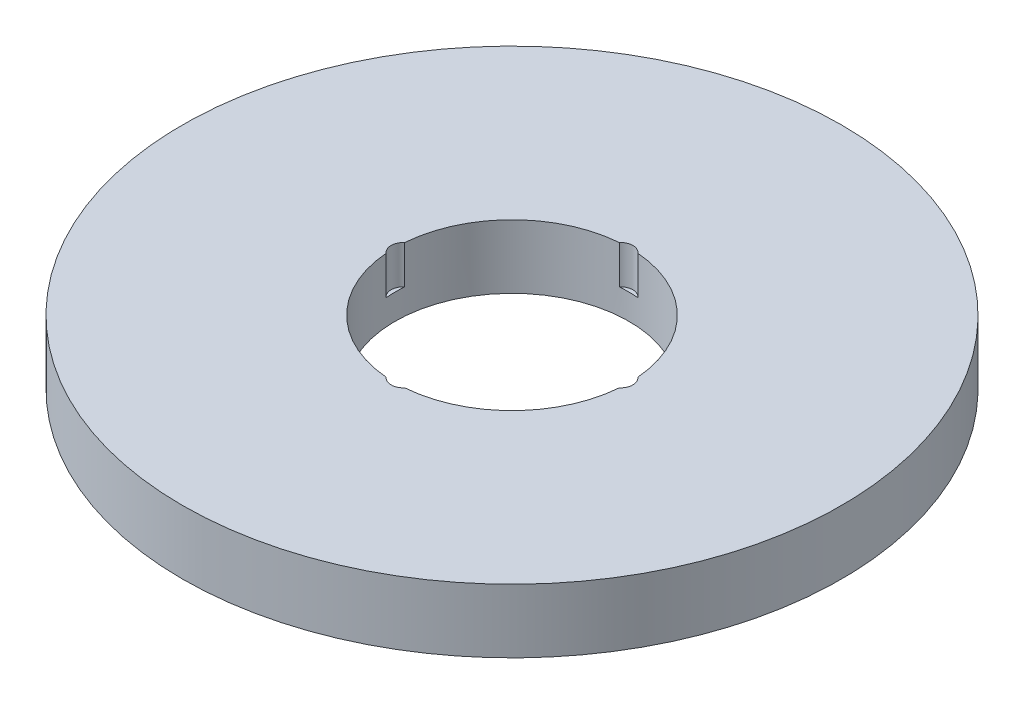
ISO-10303-21;
HEADER;
FILE_DESCRIPTION(('STEP AP214'),'2;1');
FILE_NAME('part.step','',(''),(''),'','','');
FILE_SCHEMA(('AUTOMOTIVE_DESIGN { 1 0 10303 214 1 1 1 1 }'));
ENDSEC;
DATA;
#1=APPLICATION_CONTEXT('core data for automotive mechanical design processes');
#2=APPLICATION_PROTOCOL_DEFINITION('international standard','automotive_design',2000,#1);
#3=PRODUCT_CONTEXT('',#1,'mechanical');
#4=PRODUCT('Part','Part','',(#3));
#5=PRODUCT_RELATED_PRODUCT_CATEGORY('part','',(#4));
#6=PRODUCT_DEFINITION_FORMATION('','',#4);
#7=PRODUCT_DEFINITION_CONTEXT('part definition',#1,'design');
#8=PRODUCT_DEFINITION('design','',#6,#7);
#9=PRODUCT_DEFINITION_SHAPE('','',#8);
#10=(LENGTH_UNIT() NAMED_UNIT(*) SI_UNIT(.MILLI.,.METRE.));
#11=(NAMED_UNIT(*) PLANE_ANGLE_UNIT() SI_UNIT($,.RADIAN.));
#12=(NAMED_UNIT(*) SI_UNIT($,.STERADIAN.) SOLID_ANGLE_UNIT());
#13=UNCERTAINTY_MEASURE_WITH_UNIT(LENGTH_MEASURE(1.E-05),#10,'distance_accuracy_value','');
#14=(GEOMETRIC_REPRESENTATION_CONTEXT(3) GLOBAL_UNCERTAINTY_ASSIGNED_CONTEXT((#13)) GLOBAL_UNIT_ASSIGNED_CONTEXT((#10,
#11,#12)) REPRESENTATION_CONTEXT('',''));
#15=CARTESIAN_POINT('',(0.,0.,0.));
#16=DIRECTION('',(0.,0.,1.));
#17=DIRECTION('',(1.,0.,0.));
#18=AXIS2_PLACEMENT_3D('',#15,#16,#17);
#19=CARTESIAN_POINT('',(0.,15.,0.));
#20=DIRECTION('',(0.,-1.,0.));
#21=DIRECTION('',(0.,0.,-1.));
#22=AXIS2_PLACEMENT_3D('',#19,#20,#21);
#23=CYLINDRICAL_SURFACE('',#22,77.5);
#24=CARTESIAN_POINT('',(0.,15.,0.));
#25=DIRECTION('',(0.,1.,0.));
#26=DIRECTION('',(0.,0.,1.));
#27=AXIS2_PLACEMENT_3D('',#24,#25,#26);
#28=CIRCLE('',#27,77.5);
#29=CARTESIAN_POINT('',(0.,15.,77.5));
#30=VERTEX_POINT('',#29);
#31=EDGE_CURVE('E148',#30,#30,#28,.T.);
#32=ORIENTED_EDGE('',*,*,#31,.F.);
#33=EDGE_LOOP('',(#32));
#34=FACE_BOUND('',#33,.T.);
#35=CARTESIAN_POINT('',(0.,0.,0.));
#36=DIRECTION('',(0.,1.,0.));
#37=DIRECTION('',(0.,0.,1.));
#38=AXIS2_PLACEMENT_3D('',#35,#36,#37);
#39=CIRCLE('',#38,77.5);
#40=CARTESIAN_POINT('',(0.,0.,77.5));
#41=VERTEX_POINT('',#40);
#42=EDGE_CURVE('E139',#41,#41,#39,.T.);
#43=ORIENTED_EDGE('',*,*,#42,.T.);
#44=EDGE_LOOP('',(#43));
#45=FACE_BOUND('',#44,.T.);
#46=ADVANCED_FACE('F39',(#34,#45),#23,.T.);
#47=CARTESIAN_POINT('',(0.,15.,0.));
#48=DIRECTION('',(0.,1.,0.));
#49=DIRECTION('',(0.,0.,1.));
#50=AXIS2_PLACEMENT_3D('',#47,#48,#49);
#51=PLANE('',#50);
#52=CARTESIAN_POINT('',(0.,15.,25.5392864798723));
#53=DIRECTION('',(0.,1.,0.));
#54=DIRECTION('',(1.,0.,0.));
#55=AXIS2_PLACEMENT_3D('',#52,#53,#54);
#56=CIRCLE('',#55,2.87919003158823);
#57=CARTESIAN_POINT('',(-2.18610225484286,15.,27.412970596624));
#58=VERTEX_POINT('',#57);
#59=CARTESIAN_POINT('',(2.18610225484306,15.,27.412970596624));
#60=VERTEX_POINT('',#59);
#61=EDGE_CURVE('E175',#58,#60,#56,.T.);
#62=ORIENTED_EDGE('',*,*,#61,.F.);
#63=CARTESIAN_POINT('',(0.,15.,0.));
#64=DIRECTION('',(0.,1.,0.));
#65=DIRECTION('',(0.,0.,1.));
#66=AXIS2_PLACEMENT_3D('',#63,#64,#65);
#67=CIRCLE('',#66,27.5);
#68=CARTESIAN_POINT('',(-27.412970596624,15.,2.18610225484296));
#69=VERTEX_POINT('',#68);
#70=EDGE_CURVE('E134',#69,#58,#67,.T.);
#71=ORIENTED_EDGE('',*,*,#70,.F.);
#72=CARTESIAN_POINT('',(-25.5392864798723,15.,0.));
#73=DIRECTION('',(0.,1.,0.));
#74=DIRECTION('',(0.,0.,1.));
#75=AXIS2_PLACEMENT_3D('',#72,#73,#74);
#76=CIRCLE('',#75,2.87919003158823);
#77=CARTESIAN_POINT('',(-27.412970596624,15.,-2.18610225484296));
#78=VERTEX_POINT('',#77);
#79=EDGE_CURVE('E143',#78,#69,#76,.T.);
#80=ORIENTED_EDGE('',*,*,#79,.F.);
#81=CARTESIAN_POINT('',(-2.18610225484325,15.,-27.4129705966239));
#82=VERTEX_POINT('',#81);
#83=EDGE_CURVE('E123',#82,#78,#67,.T.);
#84=ORIENTED_EDGE('',*,*,#83,.F.);
#85=CARTESIAN_POINT('',(-2.67509826455528E-13,15.,-25.5392864798723));
#86=DIRECTION('',(0.,1.,0.));
#87=DIRECTION('',(-1.,0.,0.));
#88=AXIS2_PLACEMENT_3D('',#85,#86,#87);
#89=CIRCLE('',#88,2.87919003158823);
#90=CARTESIAN_POINT('',(2.18610225484267,15.,-27.412970596624));
#91=VERTEX_POINT('',#90);
#92=EDGE_CURVE('E106',#91,#82,#89,.T.);
#93=ORIENTED_EDGE('',*,*,#92,.F.);
#94=CARTESIAN_POINT('',(27.412970596624,15.,-2.18610225484296));
#95=VERTEX_POINT('',#94);
#96=EDGE_CURVE('E125',#95,#91,#67,.T.);
#97=ORIENTED_EDGE('',*,*,#96,.F.);
#98=CARTESIAN_POINT('',(25.5392864798723,15.,0.));
#99=DIRECTION('',(0.,1.,0.));
#100=DIRECTION('',(0.,0.,-1.));
#101=AXIS2_PLACEMENT_3D('',#98,#99,#100);
#102=CIRCLE('',#101,2.87919003158823);
#103=CARTESIAN_POINT('',(27.412970596624,15.,2.18610225484296));
#104=VERTEX_POINT('',#103);
#105=EDGE_CURVE('E286',#104,#95,#102,.T.);
#106=ORIENTED_EDGE('',*,*,#105,.F.);
#107=EDGE_CURVE('E135',#60,#104,#67,.T.);
#108=ORIENTED_EDGE('',*,*,#107,.F.);
#109=EDGE_LOOP('',(#62,#71,#80,#84,#93,#97,#106,#108));
#110=FACE_BOUND('',#109,.T.);
#111=ORIENTED_EDGE('',*,*,#31,.T.);
#112=EDGE_LOOP('',(#111));
#113=FACE_BOUND('',#112,.T.);
#114=ADVANCED_FACE('F118',(#110,#113),#51,.T.);
#115=CARTESIAN_POINT('',(0.,0.,0.));
#116=DIRECTION('',(0.,1.,0.));
#117=DIRECTION('',(0.,0.,1.));
#118=AXIS2_PLACEMENT_3D('',#115,#116,#117);
#119=PLANE('',#118);
#120=CARTESIAN_POINT('',(0.,0.,0.));
#121=DIRECTION('',(0.,1.,0.));
#122=DIRECTION('',(0.,0.,1.));
#123=AXIS2_PLACEMENT_3D('',#120,#121,#122);
#124=CIRCLE('',#123,27.5);
#125=CARTESIAN_POINT('',(0.,0.,27.5));
#126=VERTEX_POINT('',#125);
#127=EDGE_CURVE('E136',#126,#126,#124,.T.);
#128=ORIENTED_EDGE('',*,*,#127,.T.);
#129=EDGE_LOOP('',(#128));
#130=FACE_BOUND('',#129,.T.);
#131=ORIENTED_EDGE('',*,*,#42,.F.);
#132=EDGE_LOOP('',(#131));
#133=FACE_BOUND('',#132,.T.);
#134=ADVANCED_FACE('F187',(#130,#133),#119,.F.);
#135=CARTESIAN_POINT('',(0.,15.,0.));
#136=DIRECTION('',(0.,-1.,0.));
#137=DIRECTION('',(0.,0.,-1.));
#138=AXIS2_PLACEMENT_3D('',#135,#136,#137);
#139=CYLINDRICAL_SURFACE('',#138,27.5);
#140=DIRECTION('',(0.,1.,0.));
#141=VECTOR('',#140,1.);
#142=CARTESIAN_POINT('',(-2.18610225484286,10.4802495077836,27.412970596624));
#143=LINE('',#142,#141);
#144=CARTESIAN_POINT('',(-2.18610225484286,5.9604990155673,27.412970596624));
#145=VERTEX_POINT('',#144);
#146=EDGE_CURVE('E11',#145,#58,#143,.T.);
#147=ORIENTED_EDGE('',*,*,#146,.F.);
#148=CARTESIAN_POINT('',(0.,5.9604990155673,0.));
#149=DIRECTION('',(0.,1.,0.));
#150=DIRECTION('',(0.,0.,1.));
#151=AXIS2_PLACEMENT_3D('',#148,#149,#150);
#152=CIRCLE('',#151,27.5);
#153=CARTESIAN_POINT('',(2.18610225484306,5.9604990155673,27.412970596624));
#154=VERTEX_POINT('',#153);
#155=EDGE_CURVE('E170',#145,#154,#152,.T.);
#156=ORIENTED_EDGE('',*,*,#155,.T.);
#157=DIRECTION('',(0.,1.,0.));
#158=VECTOR('',#157,1.);
#159=CARTESIAN_POINT('',(2.18610225484305,10.4802495077836,27.412970596624));
#160=LINE('',#159,#158);
#161=EDGE_CURVE('E46',#60,#154,#160,.F.);
#162=ORIENTED_EDGE('',*,*,#161,.F.);
#163=ORIENTED_EDGE('',*,*,#107,.T.);
#164=DIRECTION('',(0.,1.,0.));
#165=VECTOR('',#164,1.);
#166=CARTESIAN_POINT('',(27.412970596624,10.4802495077836,2.18610225484295));
#167=LINE('',#166,#165);
#168=CARTESIAN_POINT('',(27.412970596624,5.9604990155673,2.18610225484296));
#169=VERTEX_POINT('',#168);
#170=EDGE_CURVE('E164',#169,#104,#167,.T.);
#171=ORIENTED_EDGE('',*,*,#170,.F.);
#172=CARTESIAN_POINT('',(0.,5.9604990155673,0.));
#173=DIRECTION('',(0.,1.,0.));
#174=DIRECTION('',(0.,0.,1.));
#175=AXIS2_PLACEMENT_3D('',#172,#173,#174);
#176=CIRCLE('',#175,27.5);
#177=CARTESIAN_POINT('',(27.412970596624,5.9604990155673,-2.18610225484296));
#178=VERTEX_POINT('',#177);
#179=EDGE_CURVE('E115',#169,#178,#176,.T.);
#180=ORIENTED_EDGE('',*,*,#179,.T.);
#181=DIRECTION('',(0.,1.,0.));
#182=VECTOR('',#181,1.);
#183=CARTESIAN_POINT('',(27.412970596624,10.4802495077836,-2.18610225484295));
#184=LINE('',#183,#182);
#185=EDGE_CURVE('E131',#95,#178,#184,.F.);
#186=ORIENTED_EDGE('',*,*,#185,.F.);
#187=ORIENTED_EDGE('',*,*,#96,.T.);
#188=DIRECTION('',(0.,1.,0.));
#189=VECTOR('',#188,1.);
#190=CARTESIAN_POINT('',(2.18610225484266,10.4802495077836,-27.412970596624));
#191=LINE('',#190,#189);
#192=CARTESIAN_POINT('',(2.18610225484267,5.9604990155673,-27.412970596624));
#193=VERTEX_POINT('',#192);
#194=EDGE_CURVE('E105',#193,#91,#191,.T.);
#195=ORIENTED_EDGE('',*,*,#194,.F.);
#196=CARTESIAN_POINT('',(0.,5.9604990155673,0.));
#197=DIRECTION('',(0.,1.,0.));
#198=DIRECTION('',(0.,0.,1.));
#199=AXIS2_PLACEMENT_3D('',#196,#197,#198);
#200=CIRCLE('',#199,27.5);
#201=CARTESIAN_POINT('',(-2.18610225484325,5.9604990155673,-27.4129705966239));
#202=VERTEX_POINT('',#201);
#203=EDGE_CURVE('E159',#193,#202,#200,.T.);
#204=ORIENTED_EDGE('',*,*,#203,.T.);
#205=DIRECTION('',(0.,1.,0.));
#206=VECTOR('',#205,1.);
#207=CARTESIAN_POINT('',(-2.18610225484324,10.4802495077836,-27.412970596624));
#208=LINE('',#207,#206);
#209=EDGE_CURVE('E114',#82,#202,#208,.F.);
#210=ORIENTED_EDGE('',*,*,#209,.F.);
#211=ORIENTED_EDGE('',*,*,#83,.T.);
#212=DIRECTION('',(0.,1.,0.));
#213=VECTOR('',#212,1.);
#214=CARTESIAN_POINT('',(-27.412970596624,10.4802495077836,-2.18610225484295));
#215=LINE('',#214,#213);
#216=CARTESIAN_POINT('',(-27.412970596624,5.9604990155673,-2.18610225484296));
#217=VERTEX_POINT('',#216);
#218=EDGE_CURVE('E160',#217,#78,#215,.T.);
#219=ORIENTED_EDGE('',*,*,#218,.F.);
#220=CARTESIAN_POINT('',(0.,5.9604990155673,0.));
#221=DIRECTION('',(0.,1.,0.));
#222=DIRECTION('',(0.,0.,1.));
#223=AXIS2_PLACEMENT_3D('',#220,#221,#222);
#224=CIRCLE('',#223,27.5);
#225=CARTESIAN_POINT('',(-27.412970596624,5.9604990155673,2.18610225484296));
#226=VERTEX_POINT('',#225);
#227=EDGE_CURVE('E149',#217,#226,#224,.T.);
#228=ORIENTED_EDGE('',*,*,#227,.T.);
#229=DIRECTION('',(0.,1.,0.));
#230=VECTOR('',#229,1.);
#231=CARTESIAN_POINT('',(-27.412970596624,10.4802495077836,2.18610225484295));
#232=LINE('',#231,#230);
#233=EDGE_CURVE('E152',#69,#226,#232,.F.);
#234=ORIENTED_EDGE('',*,*,#233,.F.);
#235=ORIENTED_EDGE('',*,*,#70,.T.);
#236=EDGE_LOOP('',(#147,#156,#162,#163,#171,#180,#186,#187,#195,#204,#210,#211,#219,#228,#234,#235));
#237=FACE_BOUND('',#236,.T.);
#238=ORIENTED_EDGE('',*,*,#127,.F.);
#239=EDGE_LOOP('',(#238));
#240=FACE_BOUND('',#239,.T.);
#241=ADVANCED_FACE('F126',(#237,#240),#139,.F.);
#242=CARTESIAN_POINT('',(-25.5392864798723,5.9604990155673,0.));
#243=DIRECTION('',(0.,1.,0.));
#244=DIRECTION('',(0.,0.,1.));
#245=AXIS2_PLACEMENT_3D('',#242,#243,#244);
#246=CYLINDRICAL_SURFACE('',#245,2.87919003158823);
#247=ORIENTED_EDGE('',*,*,#218,.T.);
#248=ORIENTED_EDGE('',*,*,#79,.T.);
#249=ORIENTED_EDGE('',*,*,#233,.T.);
#250=CARTESIAN_POINT('',(-25.5392864798723,5.9604990155673,0.));
#251=DIRECTION('',(0.,1.,0.));
#252=DIRECTION('',(0.,0.,1.));
#253=AXIS2_PLACEMENT_3D('',#250,#251,#252);
#254=CIRCLE('',#253,2.87919003158823);
#255=EDGE_CURVE('E144',#217,#226,#254,.T.);
#256=ORIENTED_EDGE('',*,*,#255,.F.);
#257=EDGE_LOOP('',(#247,#248,#249,#256));
#258=FACE_BOUND('',#257,.T.);
#259=ADVANCED_FACE('F200',(#258),#246,.F.);
#260=CARTESIAN_POINT('',(-25.5392864798723,5.9604990155673,0.));
#261=DIRECTION('',(0.,1.,0.));
#262=DIRECTION('',(0.,0.,1.));
#263=AXIS2_PLACEMENT_3D('',#260,#261,#262);
#264=PLANE('',#263);
#265=ORIENTED_EDGE('',*,*,#255,.T.);
#266=ORIENTED_EDGE('',*,*,#227,.F.);
#267=EDGE_LOOP('',(#265,#266));
#268=FACE_BOUND('',#267,.T.);
#269=ADVANCED_FACE('F201',(#268),#264,.T.);
#270=CARTESIAN_POINT('',(-2.67509826455528E-13,5.9604990155673,-25.5392864798723));
#271=DIRECTION('',(0.,1.,0.));
#272=DIRECTION('',(0.,0.,1.));
#273=AXIS2_PLACEMENT_3D('',#270,#271,#272);
#274=CYLINDRICAL_SURFACE('',#273,2.87919003158823);
#275=ORIENTED_EDGE('',*,*,#194,.T.);
#276=ORIENTED_EDGE('',*,*,#92,.T.);
#277=ORIENTED_EDGE('',*,*,#209,.T.);
#278=CARTESIAN_POINT('',(-2.67509826455528E-13,5.9604990155673,-25.5392864798723));
#279=DIRECTION('',(0.,1.,0.));
#280=DIRECTION('',(-1.,0.,0.));
#281=AXIS2_PLACEMENT_3D('',#278,#279,#280);
#282=CIRCLE('',#281,2.87919003158823);
#283=EDGE_CURVE('E107',#193,#202,#282,.T.);
#284=ORIENTED_EDGE('',*,*,#283,.F.);
#285=EDGE_LOOP('',(#275,#276,#277,#284));
#286=FACE_BOUND('',#285,.T.);
#287=ADVANCED_FACE('F102',(#286),#274,.F.);
#288=CARTESIAN_POINT('',(-2.67509826455528E-13,5.9604990155673,-25.5392864798723));
#289=DIRECTION('',(0.,1.,0.));
#290=DIRECTION('',(-1.,0.,0.));
#291=AXIS2_PLACEMENT_3D('',#288,#289,#290);
#292=PLANE('',#291);
#293=ORIENTED_EDGE('',*,*,#283,.T.);
#294=ORIENTED_EDGE('',*,*,#203,.F.);
#295=EDGE_LOOP('',(#293,#294));
#296=FACE_BOUND('',#295,.T.);
#297=ADVANCED_FACE('F209',(#296),#292,.T.);
#298=CARTESIAN_POINT('',(25.5392864798723,5.9604990155673,0.));
#299=DIRECTION('',(0.,1.,0.));
#300=DIRECTION('',(0.,0.,1.));
#301=AXIS2_PLACEMENT_3D('',#298,#299,#300);
#302=CYLINDRICAL_SURFACE('',#301,2.87919003158823);
#303=ORIENTED_EDGE('',*,*,#170,.T.);
#304=ORIENTED_EDGE('',*,*,#105,.T.);
#305=ORIENTED_EDGE('',*,*,#185,.T.);
#306=CARTESIAN_POINT('',(25.5392864798723,5.9604990155673,0.));
#307=DIRECTION('',(0.,1.,0.));
#308=DIRECTION('',(0.,0.,-1.));
#309=AXIS2_PLACEMENT_3D('',#306,#307,#308);
#310=CIRCLE('',#309,2.87919003158823);
#311=EDGE_CURVE('E56',#169,#178,#310,.T.);
#312=ORIENTED_EDGE('',*,*,#311,.F.);
#313=EDGE_LOOP('',(#303,#304,#305,#312));
#314=FACE_BOUND('',#313,.T.);
#315=ADVANCED_FACE('F213',(#314),#302,.F.);
#316=CARTESIAN_POINT('',(25.5392864798723,5.9604990155673,0.));
#317=DIRECTION('',(0.,1.,0.));
#318=DIRECTION('',(0.,0.,-1.));
#319=AXIS2_PLACEMENT_3D('',#316,#317,#318);
#320=PLANE('',#319);
#321=ORIENTED_EDGE('',*,*,#311,.T.);
#322=ORIENTED_EDGE('',*,*,#179,.F.);
#323=EDGE_LOOP('',(#321,#322));
#324=FACE_BOUND('',#323,.T.);
#325=ADVANCED_FACE('F179',(#324),#320,.T.);
#326=CARTESIAN_POINT('',(0.,5.9604990155673,25.5392864798723));
#327=DIRECTION('',(0.,1.,0.));
#328=DIRECTION('',(0.,0.,1.));
#329=AXIS2_PLACEMENT_3D('',#326,#327,#328);
#330=CYLINDRICAL_SURFACE('',#329,2.87919003158823);
#331=ORIENTED_EDGE('',*,*,#146,.T.);
#332=ORIENTED_EDGE('',*,*,#61,.T.);
#333=ORIENTED_EDGE('',*,*,#161,.T.);
#334=CARTESIAN_POINT('',(0.,5.9604990155673,25.5392864798723));
#335=DIRECTION('',(0.,1.,0.));
#336=DIRECTION('',(1.,0.,0.));
#337=AXIS2_PLACEMENT_3D('',#334,#335,#336);
#338=CIRCLE('',#337,2.87919003158823);
#339=EDGE_CURVE('E55',#145,#154,#338,.T.);
#340=ORIENTED_EDGE('',*,*,#339,.F.);
#341=EDGE_LOOP('',(#331,#332,#333,#340));
#342=FACE_BOUND('',#341,.T.);
#343=ADVANCED_FACE('F171',(#342),#330,.F.);
#344=CARTESIAN_POINT('',(0.,5.9604990155673,25.5392864798723));
#345=DIRECTION('',(0.,1.,0.));
#346=DIRECTION('',(1.,0.,0.));
#347=AXIS2_PLACEMENT_3D('',#344,#345,#346);
#348=PLANE('',#347);
#349=ORIENTED_EDGE('',*,*,#339,.T.);
#350=ORIENTED_EDGE('',*,*,#155,.F.);
#351=EDGE_LOOP('',(#349,#350));
#352=FACE_BOUND('',#351,.T.);
#353=ADVANCED_FACE('F173',(#352),#348,.T.);
#354=CLOSED_SHELL('',(#46,#114,#134,#241,#259,#269,#287,#297,#315,#325,#343,#353));
#355=MANIFOLD_SOLID_BREP('B2',#354);
#356=ADVANCED_BREP_SHAPE_REPRESENTATION('',(#18,#355),#14);
#357=SHAPE_DEFINITION_REPRESENTATION(#9,#356);
ENDSEC;
END-ISO-10303-21;
